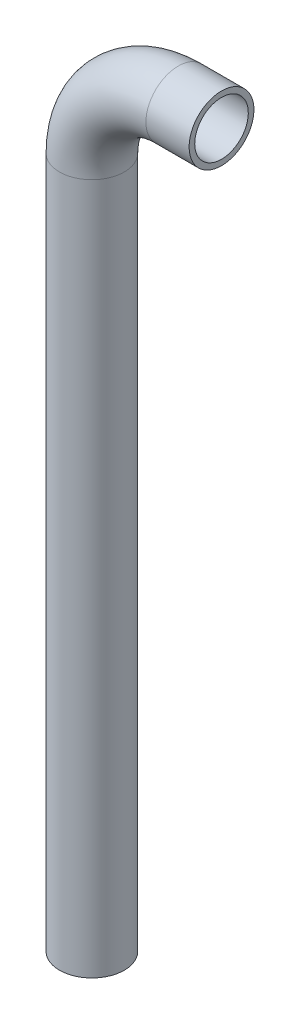
ISO-10303-21;
HEADER;
FILE_DESCRIPTION(('STEP AP214'),'2;1');
FILE_NAME('part.step','',(''),(''),'','','');
FILE_SCHEMA(('AUTOMOTIVE_DESIGN { 1 0 10303 214 1 1 1 1 }'));
ENDSEC;
DATA;
#1=APPLICATION_CONTEXT('core data for automotive mechanical design processes');
#2=APPLICATION_PROTOCOL_DEFINITION('international standard','automotive_design',2000,#1);
#3=PRODUCT_CONTEXT('',#1,'mechanical');
#4=PRODUCT('Part','Part','',(#3));
#5=PRODUCT_RELATED_PRODUCT_CATEGORY('part','',(#4));
#6=PRODUCT_DEFINITION_FORMATION('','',#4);
#7=PRODUCT_DEFINITION_CONTEXT('part definition',#1,'design');
#8=PRODUCT_DEFINITION('design','',#6,#7);
#9=PRODUCT_DEFINITION_SHAPE('','',#8);
#10=(LENGTH_UNIT() NAMED_UNIT(*) SI_UNIT(.MILLI.,.METRE.));
#11=(NAMED_UNIT(*) PLANE_ANGLE_UNIT() SI_UNIT($,.RADIAN.));
#12=(NAMED_UNIT(*) SI_UNIT($,.STERADIAN.) SOLID_ANGLE_UNIT());
#13=UNCERTAINTY_MEASURE_WITH_UNIT(LENGTH_MEASURE(1.E-05),#10,'distance_accuracy_value','');
#14=(GEOMETRIC_REPRESENTATION_CONTEXT(3) GLOBAL_UNCERTAINTY_ASSIGNED_CONTEXT((#13)) GLOBAL_UNIT_ASSIGNED_CONTEXT((#10,
#11,#12)) REPRESENTATION_CONTEXT('',''));
#15=CARTESIAN_POINT('',(0.,0.,0.));
#16=DIRECTION('',(0.,0.,1.));
#17=DIRECTION('',(1.,0.,0.));
#18=AXIS2_PLACEMENT_3D('',#15,#16,#17);
#19=CARTESIAN_POINT('',(0.,0.,0.));
#20=DIRECTION('',(0.,1.,0.));
#21=DIRECTION('',(0.,0.,1.));
#22=AXIS2_PLACEMENT_3D('',#19,#20,#21);
#23=CYLINDRICAL_SURFACE('',#22,9.525);
#24=CARTESIAN_POINT('',(0.,203.2,0.));
#25=DIRECTION('',(0.,1.,0.));
#26=DIRECTION('',(0.,0.,1.));
#27=AXIS2_PLACEMENT_3D('',#24,#25,#26);
#28=CIRCLE('',#27,9.525);
#29=CARTESIAN_POINT('',(-9.52500000000001,203.2,0.));
#30=VERTEX_POINT('',#29);
#31=EDGE_CURVE('E55',#30,#30,#28,.T.);
#32=ORIENTED_EDGE('',*,*,#31,.F.);
#33=EDGE_LOOP('',(#32));
#34=FACE_BOUND('',#33,.T.);
#35=CARTESIAN_POINT('',(0.,0.,0.));
#36=DIRECTION('',(0.,1.,0.));
#37=DIRECTION('',(0.,0.,1.));
#38=AXIS2_PLACEMENT_3D('',#35,#36,#37);
#39=CIRCLE('',#38,9.525);
#40=CARTESIAN_POINT('',(0.,0.,9.525));
#41=VERTEX_POINT('',#40);
#42=EDGE_CURVE('E53',#41,#41,#39,.T.);
#43=ORIENTED_EDGE('',*,*,#42,.T.);
#44=EDGE_LOOP('',(#43));
#45=FACE_BOUND('',#44,.T.);
#46=ADVANCED_FACE('F32',(#34,#45),#23,.T.);
#47=CARTESIAN_POINT('',(25.4,203.2,0.));
#48=DIRECTION('',(0.,0.,-1.));
#49=DIRECTION('',(-1.,0.,0.));
#50=AXIS2_PLACEMENT_3D('',#47,#48,#49);
#51=TOROIDAL_SURFACE('',#50,25.4,9.525);
#52=CARTESIAN_POINT('',(25.4,228.6,0.));
#53=DIRECTION('',(1.,0.,0.));
#54=DIRECTION('',(0.,0.,1.));
#55=AXIS2_PLACEMENT_3D('',#52,#53,#54);
#56=CIRCLE('',#55,9.525);
#57=CARTESIAN_POINT('',(25.4,238.125,0.));
#58=VERTEX_POINT('',#57);
#59=EDGE_CURVE('E36',#58,#58,#56,.T.);
#60=CARTESIAN_POINT('',(25.4,203.2,0.));
#61=DIRECTION('',(0.,0.,-1.));
#62=DIRECTION('',(-1.,0.,0.));
#63=AXIS2_PLACEMENT_3D('',#60,#61,#62);
#64=CIRCLE('',#63,34.925);
#65=EDGE_CURVE('',#30,#58,#64,.T.);
#66=ORIENTED_EDGE('',*,*,#31,.T.);
#67=ORIENTED_EDGE('',*,*,#59,.F.);
#68=ORIENTED_EDGE('',*,*,#65,.T.);
#69=ORIENTED_EDGE('',*,*,#65,.F.);
#70=EDGE_LOOP('',(#66,#68,#67,#69));
#71=FACE_BOUND('',#70,.T.);
#72=ADVANCED_FACE('F63',(#71),#51,.T.);
#73=CARTESIAN_POINT('',(25.4,228.6,0.));
#74=DIRECTION('',(1.,0.,0.));
#75=DIRECTION('',(0.,0.,-1.));
#76=AXIS2_PLACEMENT_3D('',#73,#74,#75);
#77=CYLINDRICAL_SURFACE('',#76,9.525);
#78=CARTESIAN_POINT('',(38.1,228.6,0.));
#79=DIRECTION('',(1.,0.,0.));
#80=DIRECTION('',(0.,0.,1.));
#81=AXIS2_PLACEMENT_3D('',#78,#79,#80);
#82=CIRCLE('',#81,9.525);
#83=CARTESIAN_POINT('',(38.1,228.6,9.525));
#84=VERTEX_POINT('',#83);
#85=EDGE_CURVE('E49',#84,#84,#82,.T.);
#86=ORIENTED_EDGE('',*,*,#85,.F.);
#87=EDGE_LOOP('',(#86));
#88=FACE_BOUND('',#87,.T.);
#89=ORIENTED_EDGE('',*,*,#59,.T.);
#90=EDGE_LOOP('',(#89));
#91=FACE_BOUND('',#90,.T.);
#92=ADVANCED_FACE('F34',(#88,#91),#77,.T.);
#93=CARTESIAN_POINT('',(0.,0.,0.));
#94=DIRECTION('',(0.,1.,0.));
#95=DIRECTION('',(0.,0.,1.));
#96=AXIS2_PLACEMENT_3D('',#93,#94,#95);
#97=PLANE('',#96);
#98=CARTESIAN_POINT('',(0.,0.,0.));
#99=DIRECTION('',(0.,1.,0.));
#100=DIRECTION('',(0.,0.,1.));
#101=AXIS2_PLACEMENT_3D('',#98,#99,#100);
#102=CIRCLE('',#101,7.874);
#103=CARTESIAN_POINT('',(0.,0.,7.874));
#104=VERTEX_POINT('',#103);
#105=EDGE_CURVE('E52',#104,#104,#102,.F.);
#106=ORIENTED_EDGE('',*,*,#105,.F.);
#107=EDGE_LOOP('',(#106));
#108=FACE_BOUND('',#107,.T.);
#109=ORIENTED_EDGE('',*,*,#42,.F.);
#110=EDGE_LOOP('',(#109));
#111=FACE_BOUND('',#110,.T.);
#112=ADVANCED_FACE('F69',(#108,#111),#97,.F.);
#113=CARTESIAN_POINT('',(38.1,228.6,0.));
#114=DIRECTION('',(1.,0.,0.));
#115=DIRECTION('',(0.,0.,1.));
#116=AXIS2_PLACEMENT_3D('',#113,#114,#115);
#117=PLANE('',#116);
#118=CARTESIAN_POINT('',(38.1,228.6,0.));
#119=DIRECTION('',(1.,0.,0.));
#120=DIRECTION('',(0.,0.,1.));
#121=AXIS2_PLACEMENT_3D('',#118,#119,#120);
#122=CIRCLE('',#121,7.874);
#123=CARTESIAN_POINT('',(38.1,228.6,7.874));
#124=VERTEX_POINT('',#123);
#125=EDGE_CURVE('E10',#124,#124,#122,.F.);
#126=ORIENTED_EDGE('',*,*,#125,.T.);
#127=EDGE_LOOP('',(#126));
#128=FACE_BOUND('',#127,.T.);
#129=ORIENTED_EDGE('',*,*,#85,.T.);
#130=EDGE_LOOP('',(#129));
#131=FACE_BOUND('',#130,.T.);
#132=ADVANCED_FACE('F87',(#128,#131),#117,.T.);
#133=CARTESIAN_POINT('',(0.,0.,0.));
#134=DIRECTION('',(0.,1.,0.));
#135=DIRECTION('',(0.,0.,1.));
#136=AXIS2_PLACEMENT_3D('',#133,#134,#135);
#137=CYLINDRICAL_SURFACE('',#136,7.874);
#138=CARTESIAN_POINT('',(0.,203.2,0.));
#139=DIRECTION('',(0.,1.,0.));
#140=DIRECTION('',(0.,0.,1.));
#141=AXIS2_PLACEMENT_3D('',#138,#139,#140);
#142=CIRCLE('',#141,7.874);
#143=CARTESIAN_POINT('',(-7.87400000000001,203.2,0.));
#144=VERTEX_POINT('',#143);
#145=EDGE_CURVE('E45',#144,#144,#142,.F.);
#146=ORIENTED_EDGE('',*,*,#145,.F.);
#147=EDGE_LOOP('',(#146));
#148=FACE_BOUND('',#147,.T.);
#149=ORIENTED_EDGE('',*,*,#105,.T.);
#150=EDGE_LOOP('',(#149));
#151=FACE_BOUND('',#150,.T.);
#152=ADVANCED_FACE('F81',(#148,#151),#137,.F.);
#153=CARTESIAN_POINT('',(25.4,203.2,0.));
#154=DIRECTION('',(0.,0.,-1.));
#155=DIRECTION('',(-1.,0.,0.));
#156=AXIS2_PLACEMENT_3D('',#153,#154,#155);
#157=TOROIDAL_SURFACE('',#156,25.4,7.874);
#158=CARTESIAN_POINT('',(25.4,228.6,0.));
#159=DIRECTION('',(1.,0.,0.));
#160=DIRECTION('',(0.,0.,1.));
#161=AXIS2_PLACEMENT_3D('',#158,#159,#160);
#162=CIRCLE('',#161,7.874);
#163=CARTESIAN_POINT('',(25.4,236.474,0.));
#164=VERTEX_POINT('',#163);
#165=EDGE_CURVE('E40',#164,#164,#162,.F.);
#166=CARTESIAN_POINT('',(25.4,203.2,0.));
#167=DIRECTION('',(0.,0.,-1.));
#168=DIRECTION('',(-1.,0.,0.));
#169=AXIS2_PLACEMENT_3D('',#166,#167,#168);
#170=CIRCLE('',#169,33.274);
#171=EDGE_CURVE('',#144,#164,#170,.T.);
#172=ORIENTED_EDGE('',*,*,#145,.T.);
#173=ORIENTED_EDGE('',*,*,#165,.F.);
#174=ORIENTED_EDGE('',*,*,#171,.T.);
#175=ORIENTED_EDGE('',*,*,#171,.F.);
#176=EDGE_LOOP('',(#172,#174,#173,#175));
#177=FACE_BOUND('',#176,.T.);
#178=ADVANCED_FACE('F75',(#177),#157,.F.);
#179=CARTESIAN_POINT('',(25.4,228.6,0.));
#180=DIRECTION('',(1.,0.,0.));
#181=DIRECTION('',(0.,0.,-1.));
#182=AXIS2_PLACEMENT_3D('',#179,#180,#181);
#183=CYLINDRICAL_SURFACE('',#182,7.874);
#184=ORIENTED_EDGE('',*,*,#125,.F.);
#185=EDGE_LOOP('',(#184));
#186=FACE_BOUND('',#185,.T.);
#187=ORIENTED_EDGE('',*,*,#165,.T.);
#188=EDGE_LOOP('',(#187));
#189=FACE_BOUND('',#188,.T.);
#190=ADVANCED_FACE('F73',(#186,#189),#183,.F.);
#191=CLOSED_SHELL('',(#46,#72,#92,#112,#132,#152,#178,#190));
#192=MANIFOLD_SOLID_BREP('B2',#191);
#193=ADVANCED_BREP_SHAPE_REPRESENTATION('',(#18,#192),#14);
#194=SHAPE_DEFINITION_REPRESENTATION(#9,#193);
ENDSEC;
END-ISO-10303-21;
